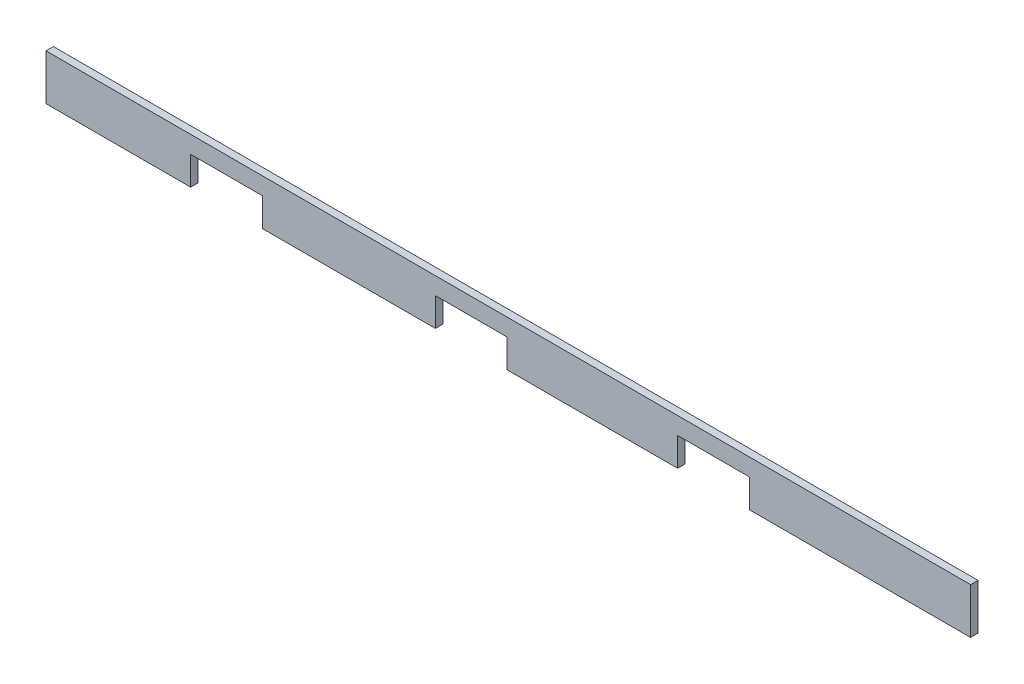
ISO-10303-21;
HEADER;
FILE_DESCRIPTION(('STEP AP214'),'2;1');
FILE_NAME('part.step','',(''),(''),'','','');
FILE_SCHEMA(('AUTOMOTIVE_DESIGN { 1 0 10303 214 1 1 1 1 }'));
ENDSEC;
DATA;
#1=APPLICATION_CONTEXT('core data for automotive mechanical design processes');
#2=APPLICATION_PROTOCOL_DEFINITION('international standard','automotive_design',2000,#1);
#3=PRODUCT_CONTEXT('',#1,'mechanical');
#4=PRODUCT('Part','Part','',(#3));
#5=PRODUCT_RELATED_PRODUCT_CATEGORY('part','',(#4));
#6=PRODUCT_DEFINITION_FORMATION('','',#4);
#7=PRODUCT_DEFINITION_CONTEXT('part definition',#1,'design');
#8=PRODUCT_DEFINITION('design','',#6,#7);
#9=PRODUCT_DEFINITION_SHAPE('','',#8);
#10=(LENGTH_UNIT() NAMED_UNIT(*) SI_UNIT(.MILLI.,.METRE.));
#11=(NAMED_UNIT(*) PLANE_ANGLE_UNIT() SI_UNIT($,.RADIAN.));
#12=(NAMED_UNIT(*) SI_UNIT($,.STERADIAN.) SOLID_ANGLE_UNIT());
#13=UNCERTAINTY_MEASURE_WITH_UNIT(LENGTH_MEASURE(1.E-05),#10,'distance_accuracy_value','');
#14=(GEOMETRIC_REPRESENTATION_CONTEXT(3) GLOBAL_UNCERTAINTY_ASSIGNED_CONTEXT((#13)) GLOBAL_UNIT_ASSIGNED_CONTEXT((#10,
#11,#12)) REPRESENTATION_CONTEXT('',''));
#15=CARTESIAN_POINT('',(0.,0.,0.));
#16=DIRECTION('',(0.,0.,1.));
#17=DIRECTION('',(1.,0.,0.));
#18=AXIS2_PLACEMENT_3D('',#15,#16,#17);
#19=CARTESIAN_POINT('',(3613.15,0.,38.1));
#20=DIRECTION('',(-1.,0.,0.));
#21=DIRECTION('',(0.,0.,1.));
#22=AXIS2_PLACEMENT_3D('',#19,#20,#21);
#23=PLANE('',#22);
#24=DIRECTION('',(0.,1.,0.));
#25=VECTOR('',#24,1.);
#26=CARTESIAN_POINT('',(3613.15,0.,0.));
#27=LINE('',#26,#25);
#28=CARTESIAN_POINT('',(3613.15,0.,0.));
#29=VERTEX_POINT('',#28);
#30=CARTESIAN_POINT('',(3613.15,146.05,0.));
#31=VERTEX_POINT('',#30);
#32=EDGE_CURVE('E178',#29,#31,#27,.T.);
#33=ORIENTED_EDGE('',*,*,#32,.F.);
#34=DIRECTION('',(0.,0.,-1.));
#35=VECTOR('',#34,1.);
#36=CARTESIAN_POINT('',(3613.15,0.,38.1));
#37=LINE('',#36,#35);
#38=CARTESIAN_POINT('',(3613.15,0.,38.1));
#39=VERTEX_POINT('',#38);
#40=EDGE_CURVE('E11',#39,#29,#37,.T.);
#41=ORIENTED_EDGE('',*,*,#40,.F.);
#42=DIRECTION('',(0.,1.,0.));
#43=VECTOR('',#42,1.);
#44=CARTESIAN_POINT('',(3613.15,0.,38.1));
#45=LINE('',#44,#43);
#46=CARTESIAN_POINT('',(3613.15,146.05,38.1));
#47=VERTEX_POINT('',#46);
#48=EDGE_CURVE('E213',#39,#47,#45,.T.);
#49=ORIENTED_EDGE('',*,*,#48,.T.);
#50=DIRECTION('',(0.,0.,-1.));
#51=VECTOR('',#50,1.);
#52=CARTESIAN_POINT('',(3613.15,146.05,38.1));
#53=LINE('',#52,#51);
#54=EDGE_CURVE('E110',#47,#31,#53,.T.);
#55=ORIENTED_EDGE('',*,*,#54,.T.);
#56=EDGE_LOOP('',(#33,#41,#49,#55));
#57=FACE_BOUND('',#56,.T.);
#58=ADVANCED_FACE('F35',(#57),#23,.T.);
#59=CARTESIAN_POINT('',(0.,0.,38.1));
#60=DIRECTION('',(0.,1.,0.));
#61=DIRECTION('',(0.,0.,1.));
#62=AXIS2_PLACEMENT_3D('',#59,#60,#61);
#63=PLANE('',#62);
#64=DIRECTION('',(1.,0.,0.));
#65=VECTOR('',#64,1.);
#66=CARTESIAN_POINT('',(0.,0.,0.));
#67=LINE('',#66,#65);
#68=CARTESIAN_POINT('',(4749.8,0.,0.));
#69=VERTEX_POINT('',#68);
#70=EDGE_CURVE('E181',#29,#69,#67,.T.);
#71=ORIENTED_EDGE('',*,*,#70,.T.);
#72=DIRECTION('',(0.,0.,-1.));
#73=VECTOR('',#72,1.);
#74=CARTESIAN_POINT('',(4749.8,0.,38.1));
#75=LINE('',#74,#73);
#76=CARTESIAN_POINT('',(4749.8,0.,38.1));
#77=VERTEX_POINT('',#76);
#78=EDGE_CURVE('E43',#77,#69,#75,.T.);
#79=ORIENTED_EDGE('',*,*,#78,.F.);
#80=DIRECTION('',(1.,0.,0.));
#81=VECTOR('',#80,1.);
#82=CARTESIAN_POINT('',(0.,0.,38.1));
#83=LINE('',#82,#81);
#84=EDGE_CURVE('E164',#39,#77,#83,.T.);
#85=ORIENTED_EDGE('',*,*,#84,.F.);
#86=ORIENTED_EDGE('',*,*,#40,.T.);
#87=EDGE_LOOP('',(#71,#79,#85,#86));
#88=FACE_BOUND('',#87,.T.);
#89=ADVANCED_FACE('F250',(#88),#63,.F.);
#90=CARTESIAN_POINT('',(4749.8,0.,38.1));
#91=DIRECTION('',(1.,0.,0.));
#92=DIRECTION('',(0.,0.,-1.));
#93=AXIS2_PLACEMENT_3D('',#90,#91,#92);
#94=PLANE('',#93);
#95=DIRECTION('',(0.,-1.,0.));
#96=VECTOR('',#95,1.);
#97=CARTESIAN_POINT('',(4749.8,0.,0.));
#98=LINE('',#97,#96);
#99=CARTESIAN_POINT('',(4749.8,234.95,0.));
#100=VERTEX_POINT('',#99);
#101=EDGE_CURVE('E184',#100,#69,#98,.T.);
#102=ORIENTED_EDGE('',*,*,#101,.F.);
#103=DIRECTION('',(0.,0.,-1.));
#104=VECTOR('',#103,1.);
#105=CARTESIAN_POINT('',(4749.8,234.95,38.1));
#106=LINE('',#105,#104);
#107=CARTESIAN_POINT('',(4749.8,234.95,38.1));
#108=VERTEX_POINT('',#107);
#109=EDGE_CURVE('E240',#108,#100,#106,.T.);
#110=ORIENTED_EDGE('',*,*,#109,.F.);
#111=DIRECTION('',(0.,-1.,0.));
#112=VECTOR('',#111,1.);
#113=CARTESIAN_POINT('',(4749.8,0.,38.1));
#114=LINE('',#113,#112);
#115=EDGE_CURVE('E247',#108,#77,#114,.T.);
#116=ORIENTED_EDGE('',*,*,#115,.T.);
#117=ORIENTED_EDGE('',*,*,#78,.T.);
#118=EDGE_LOOP('',(#102,#110,#116,#117));
#119=FACE_BOUND('',#118,.T.);
#120=ADVANCED_FACE('F245',(#119),#94,.T.);
#121=CARTESIAN_POINT('',(0.,234.95,38.1));
#122=DIRECTION('',(0.,1.,0.));
#123=DIRECTION('',(0.,0.,1.));
#124=AXIS2_PLACEMENT_3D('',#121,#122,#123);
#125=PLANE('',#124);
#126=DIRECTION('',(1.,0.,0.));
#127=VECTOR('',#126,1.);
#128=CARTESIAN_POINT('',(0.,234.95,0.));
#129=LINE('',#128,#127);
#130=CARTESIAN_POINT('',(0.,234.95,0.));
#131=VERTEX_POINT('',#130);
#132=EDGE_CURVE('E188',#131,#100,#129,.T.);
#133=ORIENTED_EDGE('',*,*,#132,.F.);
#134=DIRECTION('',(0.,0.,-1.));
#135=VECTOR('',#134,1.);
#136=CARTESIAN_POINT('',(0.,234.95,38.1));
#137=LINE('',#136,#135);
#138=CARTESIAN_POINT('',(0.,234.95,38.1));
#139=VERTEX_POINT('',#138);
#140=EDGE_CURVE('E238',#139,#131,#137,.T.);
#141=ORIENTED_EDGE('',*,*,#140,.F.);
#142=DIRECTION('',(1.,0.,0.));
#143=VECTOR('',#142,1.);
#144=CARTESIAN_POINT('',(0.,234.95,38.1));
#145=LINE('',#144,#143);
#146=EDGE_CURVE('E261',#139,#108,#145,.T.);
#147=ORIENTED_EDGE('',*,*,#146,.T.);
#148=ORIENTED_EDGE('',*,*,#109,.T.);
#149=EDGE_LOOP('',(#133,#141,#147,#148));
#150=FACE_BOUND('',#149,.T.);
#151=ADVANCED_FACE('F257',(#150),#125,.T.);
#152=CARTESIAN_POINT('',(0.,0.,38.1));
#153=DIRECTION('',(1.,0.,0.));
#154=DIRECTION('',(0.,1.,0.));
#155=AXIS2_PLACEMENT_3D('',#152,#153,#154);
#156=PLANE('',#155);
#157=DIRECTION('',(0.,-1.,0.));
#158=VECTOR('',#157,1.);
#159=CARTESIAN_POINT('',(0.,0.,0.));
#160=LINE('',#159,#158);
#161=CARTESIAN_POINT('',(0.,0.,0.));
#162=VERTEX_POINT('',#161);
#163=EDGE_CURVE('E191',#131,#162,#160,.T.);
#164=ORIENTED_EDGE('',*,*,#163,.T.);
#165=DIRECTION('',(0.,0.,-1.));
#166=VECTOR('',#165,1.);
#167=CARTESIAN_POINT('',(0.,0.,38.1));
#168=LINE('',#167,#166);
#169=CARTESIAN_POINT('',(0.,0.,38.1));
#170=VERTEX_POINT('',#169);
#171=EDGE_CURVE('E235',#170,#162,#168,.T.);
#172=ORIENTED_EDGE('',*,*,#171,.F.);
#173=DIRECTION('',(0.,-1.,0.));
#174=VECTOR('',#173,1.);
#175=CARTESIAN_POINT('',(0.,0.,38.1));
#176=LINE('',#175,#174);
#177=EDGE_CURVE('E263',#139,#170,#176,.T.);
#178=ORIENTED_EDGE('',*,*,#177,.F.);
#179=ORIENTED_EDGE('',*,*,#140,.T.);
#180=EDGE_LOOP('',(#164,#172,#178,#179));
#181=FACE_BOUND('',#180,.T.);
#182=ADVANCED_FACE('F421',(#181),#156,.F.);
#183=CARTESIAN_POINT('',(742.95,0.,0.));
#184=VERTEX_POINT('',#183);
#185=EDGE_CURVE('E185',#162,#184,#67,.T.);
#186=ORIENTED_EDGE('',*,*,#185,.T.);
#187=DIRECTION('',(0.,0.,-1.));
#188=VECTOR('',#187,1.);
#189=CARTESIAN_POINT('',(742.95,0.,38.1));
#190=LINE('',#189,#188);
#191=CARTESIAN_POINT('',(742.95,0.,38.1));
#192=VERTEX_POINT('',#191);
#193=EDGE_CURVE('E232',#192,#184,#190,.T.);
#194=ORIENTED_EDGE('',*,*,#193,.F.);
#195=EDGE_CURVE('E265',#170,#192,#83,.T.);
#196=ORIENTED_EDGE('',*,*,#195,.F.);
#197=ORIENTED_EDGE('',*,*,#171,.T.);
#198=EDGE_LOOP('',(#186,#194,#196,#197));
#199=FACE_BOUND('',#198,.T.);
#200=ADVANCED_FACE('F290',(#199),#63,.F.);
#201=CARTESIAN_POINT('',(742.95,0.,38.1));
#202=DIRECTION('',(-1.,0.,0.));
#203=DIRECTION('',(0.,0.,1.));
#204=AXIS2_PLACEMENT_3D('',#201,#202,#203);
#205=PLANE('',#204);
#206=DIRECTION('',(0.,1.,0.));
#207=VECTOR('',#206,1.);
#208=CARTESIAN_POINT('',(742.95,0.,0.));
#209=LINE('',#208,#207);
#210=CARTESIAN_POINT('',(742.95,146.05,0.));
#211=VERTEX_POINT('',#210);
#212=EDGE_CURVE('E193',#184,#211,#209,.T.);
#213=ORIENTED_EDGE('',*,*,#212,.T.);
#214=DIRECTION('',(0.,0.,-1.));
#215=VECTOR('',#214,1.);
#216=CARTESIAN_POINT('',(742.95,146.05,38.1));
#217=LINE('',#216,#215);
#218=CARTESIAN_POINT('',(742.95,146.05,38.1));
#219=VERTEX_POINT('',#218);
#220=EDGE_CURVE('E229',#219,#211,#217,.T.);
#221=ORIENTED_EDGE('',*,*,#220,.F.);
#222=DIRECTION('',(0.,1.,0.));
#223=VECTOR('',#222,1.);
#224=CARTESIAN_POINT('',(742.95,0.,38.1));
#225=LINE('',#224,#223);
#226=EDGE_CURVE('E269',#192,#219,#225,.T.);
#227=ORIENTED_EDGE('',*,*,#226,.F.);
#228=ORIENTED_EDGE('',*,*,#193,.T.);
#229=EDGE_LOOP('',(#213,#221,#227,#228));
#230=FACE_BOUND('',#229,.T.);
#231=ADVANCED_FACE('F296',(#230),#205,.F.);
#232=CARTESIAN_POINT('',(0.,146.05,38.1));
#233=DIRECTION('',(0.,1.,0.));
#234=DIRECTION('',(0.,0.,1.));
#235=AXIS2_PLACEMENT_3D('',#232,#233,#234);
#236=PLANE('',#235);
#237=DIRECTION('',(1.,0.,0.));
#238=VECTOR('',#237,1.);
#239=CARTESIAN_POINT('',(0.,146.05,0.));
#240=LINE('',#239,#238);
#241=CARTESIAN_POINT('',(1111.25,146.05,0.));
#242=VERTEX_POINT('',#241);
#243=EDGE_CURVE('E195',#211,#242,#240,.T.);
#244=ORIENTED_EDGE('',*,*,#243,.T.);
#245=DIRECTION('',(0.,0.,-1.));
#246=VECTOR('',#245,1.);
#247=CARTESIAN_POINT('',(1111.25,146.05,38.1));
#248=LINE('',#247,#246);
#249=CARTESIAN_POINT('',(1111.25,146.05,38.1));
#250=VERTEX_POINT('',#249);
#251=EDGE_CURVE('E227',#250,#242,#248,.T.);
#252=ORIENTED_EDGE('',*,*,#251,.F.);
#253=DIRECTION('',(1.,0.,0.));
#254=VECTOR('',#253,1.);
#255=CARTESIAN_POINT('',(0.,146.05,38.1));
#256=LINE('',#255,#254);
#257=EDGE_CURVE('E271',#219,#250,#256,.T.);
#258=ORIENTED_EDGE('',*,*,#257,.F.);
#259=ORIENTED_EDGE('',*,*,#220,.T.);
#260=EDGE_LOOP('',(#244,#252,#258,#259));
#261=FACE_BOUND('',#260,.T.);
#262=ADVANCED_FACE('F302',(#261),#236,.F.);
#263=CARTESIAN_POINT('',(1111.25,0.,38.1));
#264=DIRECTION('',(-1.,0.,0.));
#265=DIRECTION('',(0.,0.,1.));
#266=AXIS2_PLACEMENT_3D('',#263,#264,#265);
#267=PLANE('',#266);
#268=DIRECTION('',(0.,1.,0.));
#269=VECTOR('',#268,1.);
#270=CARTESIAN_POINT('',(1111.25,0.,0.));
#271=LINE('',#270,#269);
#272=CARTESIAN_POINT('',(1111.25,0.,0.));
#273=VERTEX_POINT('',#272);
#274=EDGE_CURVE('E198',#273,#242,#271,.T.);
#275=ORIENTED_EDGE('',*,*,#274,.F.);
#276=DIRECTION('',(0.,0.,-1.));
#277=VECTOR('',#276,1.);
#278=CARTESIAN_POINT('',(1111.25,0.,38.1));
#279=LINE('',#278,#277);
#280=CARTESIAN_POINT('',(1111.25,0.,38.1));
#281=VERTEX_POINT('',#280);
#282=EDGE_CURVE('E225',#281,#273,#279,.T.);
#283=ORIENTED_EDGE('',*,*,#282,.F.);
#284=DIRECTION('',(0.,1.,0.));
#285=VECTOR('',#284,1.);
#286=CARTESIAN_POINT('',(1111.25,0.,38.1));
#287=LINE('',#286,#285);
#288=EDGE_CURVE('E273',#281,#250,#287,.T.);
#289=ORIENTED_EDGE('',*,*,#288,.T.);
#290=ORIENTED_EDGE('',*,*,#251,.T.);
#291=EDGE_LOOP('',(#275,#283,#289,#290));
#292=FACE_BOUND('',#291,.T.);
#293=ADVANCED_FACE('F315',(#292),#267,.T.);
#294=CARTESIAN_POINT('',(2000.25,0.,0.));
#295=VERTEX_POINT('',#294);
#296=EDGE_CURVE('E201',#273,#295,#67,.T.);
#297=ORIENTED_EDGE('',*,*,#296,.T.);
#298=DIRECTION('',(0.,0.,-1.));
#299=VECTOR('',#298,1.);
#300=CARTESIAN_POINT('',(2000.25,0.,38.1));
#301=LINE('',#300,#299);
#302=CARTESIAN_POINT('',(2000.25,0.,38.1));
#303=VERTEX_POINT('',#302);
#304=EDGE_CURVE('E222',#303,#295,#301,.T.);
#305=ORIENTED_EDGE('',*,*,#304,.F.);
#306=EDGE_CURVE('E163',#281,#303,#83,.T.);
#307=ORIENTED_EDGE('',*,*,#306,.F.);
#308=ORIENTED_EDGE('',*,*,#282,.T.);
#309=EDGE_LOOP('',(#297,#305,#307,#308));
#310=FACE_BOUND('',#309,.T.);
#311=ADVANCED_FACE('F308',(#310),#63,.F.);
#312=CARTESIAN_POINT('',(2000.25,0.,38.1));
#313=DIRECTION('',(-1.,0.,0.));
#314=DIRECTION('',(0.,0.,1.));
#315=AXIS2_PLACEMENT_3D('',#312,#313,#314);
#316=PLANE('',#315);
#317=DIRECTION('',(0.,1.,0.));
#318=VECTOR('',#317,1.);
#319=CARTESIAN_POINT('',(2000.25,0.,0.));
#320=LINE('',#319,#318);
#321=CARTESIAN_POINT('',(2000.25,146.05,0.));
#322=VERTEX_POINT('',#321);
#323=EDGE_CURVE('E202',#295,#322,#320,.T.);
#324=ORIENTED_EDGE('',*,*,#323,.T.);
#325=DIRECTION('',(0.,0.,-1.));
#326=VECTOR('',#325,1.);
#327=CARTESIAN_POINT('',(2000.25,146.05,38.1));
#328=LINE('',#327,#326);
#329=CARTESIAN_POINT('',(2000.25,146.05,38.1));
#330=VERTEX_POINT('',#329);
#331=EDGE_CURVE('E219',#330,#322,#328,.T.);
#332=ORIENTED_EDGE('',*,*,#331,.F.);
#333=DIRECTION('',(0.,1.,0.));
#334=VECTOR('',#333,1.);
#335=CARTESIAN_POINT('',(2000.25,0.,38.1));
#336=LINE('',#335,#334);
#337=EDGE_CURVE('E276',#303,#330,#336,.T.);
#338=ORIENTED_EDGE('',*,*,#337,.F.);
#339=ORIENTED_EDGE('',*,*,#304,.T.);
#340=EDGE_LOOP('',(#324,#332,#338,#339));
#341=FACE_BOUND('',#340,.T.);
#342=ADVANCED_FACE('F311',(#341),#316,.F.);
#343=CARTESIAN_POINT('',(0.,146.05,38.1));
#344=DIRECTION('',(0.,1.,0.));
#345=DIRECTION('',(0.,0.,1.));
#346=AXIS2_PLACEMENT_3D('',#343,#344,#345);
#347=PLANE('',#346);
#348=DIRECTION('',(1.,0.,0.));
#349=VECTOR('',#348,1.);
#350=CARTESIAN_POINT('',(0.,146.05,0.));
#351=LINE('',#350,#349);
#352=CARTESIAN_POINT('',(2368.55,146.05,0.));
#353=VERTEX_POINT('',#352);
#354=EDGE_CURVE('E204',#322,#353,#351,.T.);
#355=ORIENTED_EDGE('',*,*,#354,.T.);
#356=DIRECTION('',(0.,0.,-1.));
#357=VECTOR('',#356,1.);
#358=CARTESIAN_POINT('',(2368.55,146.05,38.1));
#359=LINE('',#358,#357);
#360=CARTESIAN_POINT('',(2368.55,146.05,38.1));
#361=VERTEX_POINT('',#360);
#362=EDGE_CURVE('E217',#361,#353,#359,.T.);
#363=ORIENTED_EDGE('',*,*,#362,.F.);
#364=DIRECTION('',(1.,0.,0.));
#365=VECTOR('',#364,1.);
#366=CARTESIAN_POINT('',(0.,146.05,38.1));
#367=LINE('',#366,#365);
#368=EDGE_CURVE('E277',#330,#361,#367,.T.);
#369=ORIENTED_EDGE('',*,*,#368,.F.);
#370=ORIENTED_EDGE('',*,*,#331,.T.);
#371=EDGE_LOOP('',(#355,#363,#369,#370));
#372=FACE_BOUND('',#371,.T.);
#373=ADVANCED_FACE('F313',(#372),#347,.F.);
#374=CARTESIAN_POINT('',(2368.55,0.,38.1));
#375=DIRECTION('',(-1.,0.,0.));
#376=DIRECTION('',(0.,0.,1.));
#377=AXIS2_PLACEMENT_3D('',#374,#375,#376);
#378=PLANE('',#377);
#379=DIRECTION('',(0.,1.,0.));
#380=VECTOR('',#379,1.);
#381=CARTESIAN_POINT('',(2368.55,0.,0.));
#382=LINE('',#381,#380);
#383=CARTESIAN_POINT('',(2368.55,0.,0.));
#384=VERTEX_POINT('',#383);
#385=EDGE_CURVE('E207',#384,#353,#382,.T.);
#386=ORIENTED_EDGE('',*,*,#385,.F.);
#387=DIRECTION('',(0.,0.,-1.));
#388=VECTOR('',#387,1.);
#389=CARTESIAN_POINT('',(2368.55,0.,38.1));
#390=LINE('',#389,#388);
#391=CARTESIAN_POINT('',(2368.55,0.,38.1));
#392=VERTEX_POINT('',#391);
#393=EDGE_CURVE('E169',#392,#384,#390,.T.);
#394=ORIENTED_EDGE('',*,*,#393,.F.);
#395=DIRECTION('',(0.,1.,0.));
#396=VECTOR('',#395,1.);
#397=CARTESIAN_POINT('',(2368.55,0.,38.1));
#398=LINE('',#397,#396);
#399=EDGE_CURVE('E160',#392,#361,#398,.T.);
#400=ORIENTED_EDGE('',*,*,#399,.T.);
#401=ORIENTED_EDGE('',*,*,#362,.T.);
#402=EDGE_LOOP('',(#386,#394,#400,#401));
#403=FACE_BOUND('',#402,.T.);
#404=ADVANCED_FACE('F282',(#403),#378,.T.);
#405=CARTESIAN_POINT('',(3244.85,0.,0.));
#406=VERTEX_POINT('',#405);
#407=EDGE_CURVE('E168',#384,#406,#67,.T.);
#408=ORIENTED_EDGE('',*,*,#407,.T.);
#409=DIRECTION('',(0.,0.,-1.));
#410=VECTOR('',#409,1.);
#411=CARTESIAN_POINT('',(3244.85,0.,38.1));
#412=LINE('',#411,#410);
#413=CARTESIAN_POINT('',(3244.85,0.,38.1));
#414=VERTEX_POINT('',#413);
#415=EDGE_CURVE('E165',#414,#406,#412,.T.);
#416=ORIENTED_EDGE('',*,*,#415,.F.);
#417=EDGE_CURVE('E154',#392,#414,#83,.T.);
#418=ORIENTED_EDGE('',*,*,#417,.F.);
#419=ORIENTED_EDGE('',*,*,#393,.T.);
#420=EDGE_LOOP('',(#408,#416,#418,#419));
#421=FACE_BOUND('',#420,.T.);
#422=ADVANCED_FACE('F166',(#421),#63,.F.);
#423=CARTESIAN_POINT('',(3244.85,0.,38.1));
#424=DIRECTION('',(-1.,0.,0.));
#425=DIRECTION('',(0.,0.,1.));
#426=AXIS2_PLACEMENT_3D('',#423,#424,#425);
#427=PLANE('',#426);
#428=DIRECTION('',(0.,1.,0.));
#429=VECTOR('',#428,1.);
#430=CARTESIAN_POINT('',(3244.85,0.,0.));
#431=LINE('',#430,#429);
#432=CARTESIAN_POINT('',(3244.85,146.05,0.));
#433=VERTEX_POINT('',#432);
#434=EDGE_CURVE('E103',#406,#433,#431,.T.);
#435=ORIENTED_EDGE('',*,*,#434,.T.);
#436=DIRECTION('',(0.,0.,-1.));
#437=VECTOR('',#436,1.);
#438=CARTESIAN_POINT('',(3244.85,146.05,38.1));
#439=LINE('',#438,#437);
#440=CARTESIAN_POINT('',(3244.85,146.05,38.1));
#441=VERTEX_POINT('',#440);
#442=EDGE_CURVE('E170',#441,#433,#439,.T.);
#443=ORIENTED_EDGE('',*,*,#442,.F.);
#444=DIRECTION('',(0.,1.,0.));
#445=VECTOR('',#444,1.);
#446=CARTESIAN_POINT('',(3244.85,0.,38.1));
#447=LINE('',#446,#445);
#448=EDGE_CURVE('E158',#414,#441,#447,.T.);
#449=ORIENTED_EDGE('',*,*,#448,.F.);
#450=ORIENTED_EDGE('',*,*,#415,.T.);
#451=EDGE_LOOP('',(#435,#443,#449,#450));
#452=FACE_BOUND('',#451,.T.);
#453=ADVANCED_FACE('F172',(#452),#427,.F.);
#454=CARTESIAN_POINT('',(0.,146.05,38.1));
#455=DIRECTION('',(0.,1.,0.));
#456=DIRECTION('',(0.,0.,1.));
#457=AXIS2_PLACEMENT_3D('',#454,#455,#456);
#458=PLANE('',#457);
#459=DIRECTION('',(1.,0.,0.));
#460=VECTOR('',#459,1.);
#461=CARTESIAN_POINT('',(0.,146.05,0.));
#462=LINE('',#461,#460);
#463=EDGE_CURVE('E211',#433,#31,#462,.T.);
#464=ORIENTED_EDGE('',*,*,#463,.T.);
#465=ORIENTED_EDGE('',*,*,#54,.F.);
#466=DIRECTION('',(1.,0.,0.));
#467=VECTOR('',#466,1.);
#468=CARTESIAN_POINT('',(0.,146.05,38.1));
#469=LINE('',#468,#467);
#470=EDGE_CURVE('E51',#441,#47,#469,.T.);
#471=ORIENTED_EDGE('',*,*,#470,.F.);
#472=ORIENTED_EDGE('',*,*,#442,.T.);
#473=EDGE_LOOP('',(#464,#465,#471,#472));
#474=FACE_BOUND('',#473,.T.);
#475=ADVANCED_FACE('F330',(#474),#458,.F.);
#476=CARTESIAN_POINT('',(0.,0.,38.1));
#477=DIRECTION('',(0.,0.,1.));
#478=DIRECTION('',(1.,0.,0.));
#479=AXIS2_PLACEMENT_3D('',#476,#477,#478);
#480=PLANE('',#479);
#481=ORIENTED_EDGE('',*,*,#48,.F.);
#482=ORIENTED_EDGE('',*,*,#84,.T.);
#483=ORIENTED_EDGE('',*,*,#115,.F.);
#484=ORIENTED_EDGE('',*,*,#146,.F.);
#485=ORIENTED_EDGE('',*,*,#177,.T.);
#486=ORIENTED_EDGE('',*,*,#195,.T.);
#487=ORIENTED_EDGE('',*,*,#226,.T.);
#488=ORIENTED_EDGE('',*,*,#257,.T.);
#489=ORIENTED_EDGE('',*,*,#288,.F.);
#490=ORIENTED_EDGE('',*,*,#306,.T.);
#491=ORIENTED_EDGE('',*,*,#337,.T.);
#492=ORIENTED_EDGE('',*,*,#368,.T.);
#493=ORIENTED_EDGE('',*,*,#399,.F.);
#494=ORIENTED_EDGE('',*,*,#417,.T.);
#495=ORIENTED_EDGE('',*,*,#448,.T.);
#496=ORIENTED_EDGE('',*,*,#470,.T.);
#497=EDGE_LOOP('',(#481,#482,#483,#484,#485,#486,#487,#488,#489,#490,#491,#492,#493,#494,#495,#496));
#498=FACE_BOUND('',#497,.T.);
#499=ADVANCED_FACE('F156',(#498),#480,.T.);
#500=CARTESIAN_POINT('',(0.,0.,0.));
#501=DIRECTION('',(0.,0.,1.));
#502=DIRECTION('',(1.,0.,0.));
#503=AXIS2_PLACEMENT_3D('',#500,#501,#502);
#504=PLANE('',#503);
#505=ORIENTED_EDGE('',*,*,#32,.T.);
#506=ORIENTED_EDGE('',*,*,#463,.F.);
#507=ORIENTED_EDGE('',*,*,#434,.F.);
#508=ORIENTED_EDGE('',*,*,#407,.F.);
#509=ORIENTED_EDGE('',*,*,#385,.T.);
#510=ORIENTED_EDGE('',*,*,#354,.F.);
#511=ORIENTED_EDGE('',*,*,#323,.F.);
#512=ORIENTED_EDGE('',*,*,#296,.F.);
#513=ORIENTED_EDGE('',*,*,#274,.T.);
#514=ORIENTED_EDGE('',*,*,#243,.F.);
#515=ORIENTED_EDGE('',*,*,#212,.F.);
#516=ORIENTED_EDGE('',*,*,#185,.F.);
#517=ORIENTED_EDGE('',*,*,#163,.F.);
#518=ORIENTED_EDGE('',*,*,#132,.T.);
#519=ORIENTED_EDGE('',*,*,#101,.T.);
#520=ORIENTED_EDGE('',*,*,#70,.F.);
#521=EDGE_LOOP('',(#505,#506,#507,#508,#509,#510,#511,#512,#513,#514,#515,#516,#517,#518,#519,#520));
#522=FACE_BOUND('',#521,.T.);
#523=ADVANCED_FACE('F252',(#522),#504,.F.);
#524=CLOSED_SHELL('',(#58,#89,#120,#151,#182,#200,#231,#262,#293,#311,#342,#373,#404,#422,#453,
#475,#499,#523));
#525=MANIFOLD_SOLID_BREP('B2',#524);
#526=ADVANCED_BREP_SHAPE_REPRESENTATION('',(#18,#525),#14);
#527=SHAPE_DEFINITION_REPRESENTATION(#9,#526);
ENDSEC;
END-ISO-10303-21;
